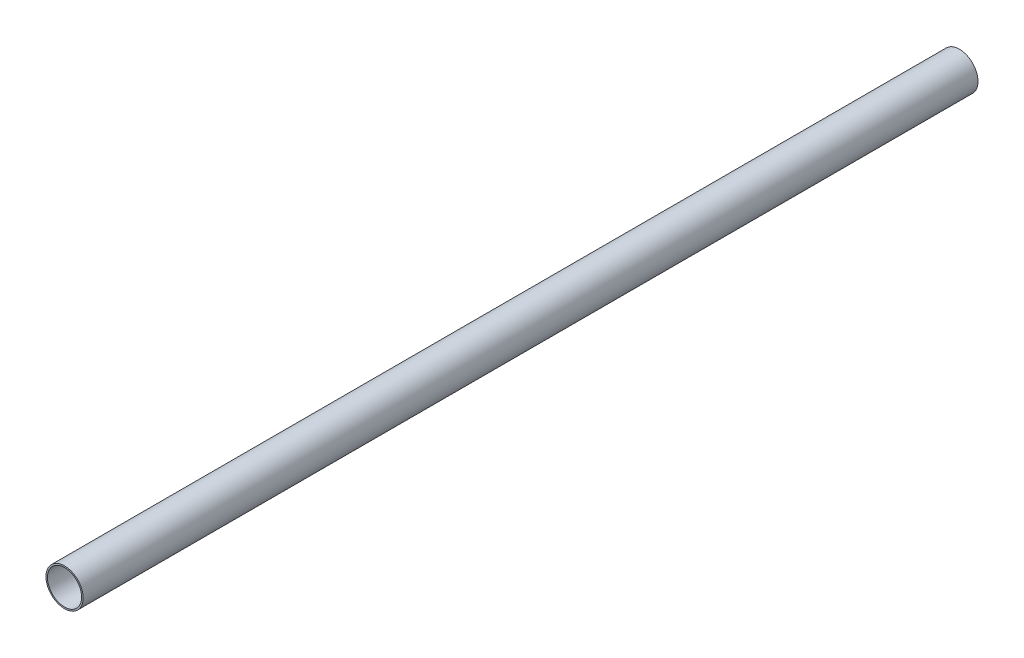
ISO-10303-21;
HEADER;
FILE_DESCRIPTION(('STEP AP214'),'2;1');
FILE_NAME('part.step','',(''),(''),'','','');
FILE_SCHEMA(('AUTOMOTIVE_DESIGN { 1 0 10303 214 1 1 1 1 }'));
ENDSEC;
DATA;
#1=APPLICATION_CONTEXT('core data for automotive mechanical design processes');
#2=APPLICATION_PROTOCOL_DEFINITION('international standard','automotive_design',2000,#1);
#3=PRODUCT_CONTEXT('',#1,'mechanical');
#4=PRODUCT('Part','Part','',(#3));
#5=PRODUCT_RELATED_PRODUCT_CATEGORY('part','',(#4));
#6=PRODUCT_DEFINITION_FORMATION('','',#4);
#7=PRODUCT_DEFINITION_CONTEXT('part definition',#1,'design');
#8=PRODUCT_DEFINITION('design','',#6,#7);
#9=PRODUCT_DEFINITION_SHAPE('','',#8);
#10=(LENGTH_UNIT() NAMED_UNIT(*) SI_UNIT(.MILLI.,.METRE.));
#11=(NAMED_UNIT(*) PLANE_ANGLE_UNIT() SI_UNIT($,.RADIAN.));
#12=(NAMED_UNIT(*) SI_UNIT($,.STERADIAN.) SOLID_ANGLE_UNIT());
#13=UNCERTAINTY_MEASURE_WITH_UNIT(LENGTH_MEASURE(1.E-05),#10,'distance_accuracy_value','');
#14=(GEOMETRIC_REPRESENTATION_CONTEXT(3) GLOBAL_UNCERTAINTY_ASSIGNED_CONTEXT((#13)) GLOBAL_UNIT_ASSIGNED_CONTEXT((#10,
#11,#12)) REPRESENTATION_CONTEXT('',''));
#15=CARTESIAN_POINT('',(0.,0.,0.));
#16=DIRECTION('',(0.,0.,1.));
#17=DIRECTION('',(1.,0.,0.));
#18=AXIS2_PLACEMENT_3D('',#15,#16,#17);
#19=CARTESIAN_POINT('',(0.,0.,330.2));
#20=DIRECTION('',(0.,0.,1.));
#21=DIRECTION('',(1.,0.,0.));
#22=AXIS2_PLACEMENT_3D('',#19,#20,#21);
#23=PLANE('',#22);
#24=CARTESIAN_POINT('',(0.,0.,330.2));
#25=DIRECTION('',(0.,0.,1.));
#26=DIRECTION('',(1.,0.,0.));
#27=AXIS2_PLACEMENT_3D('',#24,#25,#26);
#28=CIRCLE('',#27,13.716);
#29=CARTESIAN_POINT('',(13.716,0.,330.2));
#30=VERTEX_POINT('',#29);
#31=EDGE_CURVE('E11',#30,#30,#28,.T.);
#32=ORIENTED_EDGE('',*,*,#31,.T.);
#33=EDGE_LOOP('',(#32));
#34=FACE_BOUND('',#33,.T.);
#35=CARTESIAN_POINT('',(0.,0.,330.2));
#36=DIRECTION('',(0.,0.,1.));
#37=DIRECTION('',(1.,0.,0.));
#38=AXIS2_PLACEMENT_3D('',#35,#36,#37);
#39=CIRCLE('',#38,12.6238);
#40=CARTESIAN_POINT('',(12.6238,0.,330.2));
#41=VERTEX_POINT('',#40);
#42=EDGE_CURVE('E48',#41,#41,#39,.T.);
#43=ORIENTED_EDGE('',*,*,#42,.F.);
#44=EDGE_LOOP('',(#43));
#45=FACE_BOUND('',#44,.T.);
#46=ADVANCED_FACE('F37',(#34,#45),#23,.T.);
#47=CARTESIAN_POINT('',(0.,0.,-330.2));
#48=DIRECTION('',(0.,0.,1.));
#49=DIRECTION('',(1.,0.,0.));
#50=AXIS2_PLACEMENT_3D('',#47,#48,#49);
#51=PLANE('',#50);
#52=CARTESIAN_POINT('',(0.,0.,-330.2));
#53=DIRECTION('',(0.,0.,1.));
#54=DIRECTION('',(1.,0.,0.));
#55=AXIS2_PLACEMENT_3D('',#52,#53,#54);
#56=CIRCLE('',#55,13.716);
#57=CARTESIAN_POINT('',(13.716,0.,-330.2));
#58=VERTEX_POINT('',#57);
#59=EDGE_CURVE('E41',#58,#58,#56,.T.);
#60=ORIENTED_EDGE('',*,*,#59,.F.);
#61=EDGE_LOOP('',(#60));
#62=FACE_BOUND('',#61,.T.);
#63=CARTESIAN_POINT('',(0.,0.,-330.2));
#64=DIRECTION('',(0.,0.,1.));
#65=DIRECTION('',(1.,0.,0.));
#66=AXIS2_PLACEMENT_3D('',#63,#64,#65);
#67=CIRCLE('',#66,12.6238);
#68=CARTESIAN_POINT('',(12.6238,0.,-330.2));
#69=VERTEX_POINT('',#68);
#70=EDGE_CURVE('E50',#69,#69,#67,.T.);
#71=ORIENTED_EDGE('',*,*,#70,.T.);
#72=EDGE_LOOP('',(#71));
#73=FACE_BOUND('',#72,.T.);
#74=ADVANCED_FACE('F60',(#62,#73),#51,.F.);
#75=CARTESIAN_POINT('',(0.,0.,330.2));
#76=DIRECTION('',(0.,0.,-1.));
#77=DIRECTION('',(-1.,0.,0.));
#78=AXIS2_PLACEMENT_3D('',#75,#76,#77);
#79=CYLINDRICAL_SURFACE('',#78,13.716);
#80=ORIENTED_EDGE('',*,*,#31,.F.);
#81=EDGE_LOOP('',(#80));
#82=FACE_BOUND('',#81,.T.);
#83=ORIENTED_EDGE('',*,*,#59,.T.);
#84=EDGE_LOOP('',(#83));
#85=FACE_BOUND('',#84,.T.);
#86=ADVANCED_FACE('F39',(#82,#85),#79,.T.);
#87=CARTESIAN_POINT('',(0.,0.,330.2));
#88=DIRECTION('',(0.,0.,-1.));
#89=DIRECTION('',(-1.,0.,0.));
#90=AXIS2_PLACEMENT_3D('',#87,#88,#89);
#91=CYLINDRICAL_SURFACE('',#90,12.6238);
#92=ORIENTED_EDGE('',*,*,#42,.T.);
#93=EDGE_LOOP('',(#92));
#94=FACE_BOUND('',#93,.T.);
#95=ORIENTED_EDGE('',*,*,#70,.F.);
#96=EDGE_LOOP('',(#95));
#97=FACE_BOUND('',#96,.T.);
#98=ADVANCED_FACE('F56',(#94,#97),#91,.F.);
#99=CLOSED_SHELL('',(#46,#74,#86,#98));
#100=MANIFOLD_SOLID_BREP('B2',#99);
#101=ADVANCED_BREP_SHAPE_REPRESENTATION('',(#18,#100),#14);
#102=SHAPE_DEFINITION_REPRESENTATION(#9,#101);
ENDSEC;
END-ISO-10303-21;
